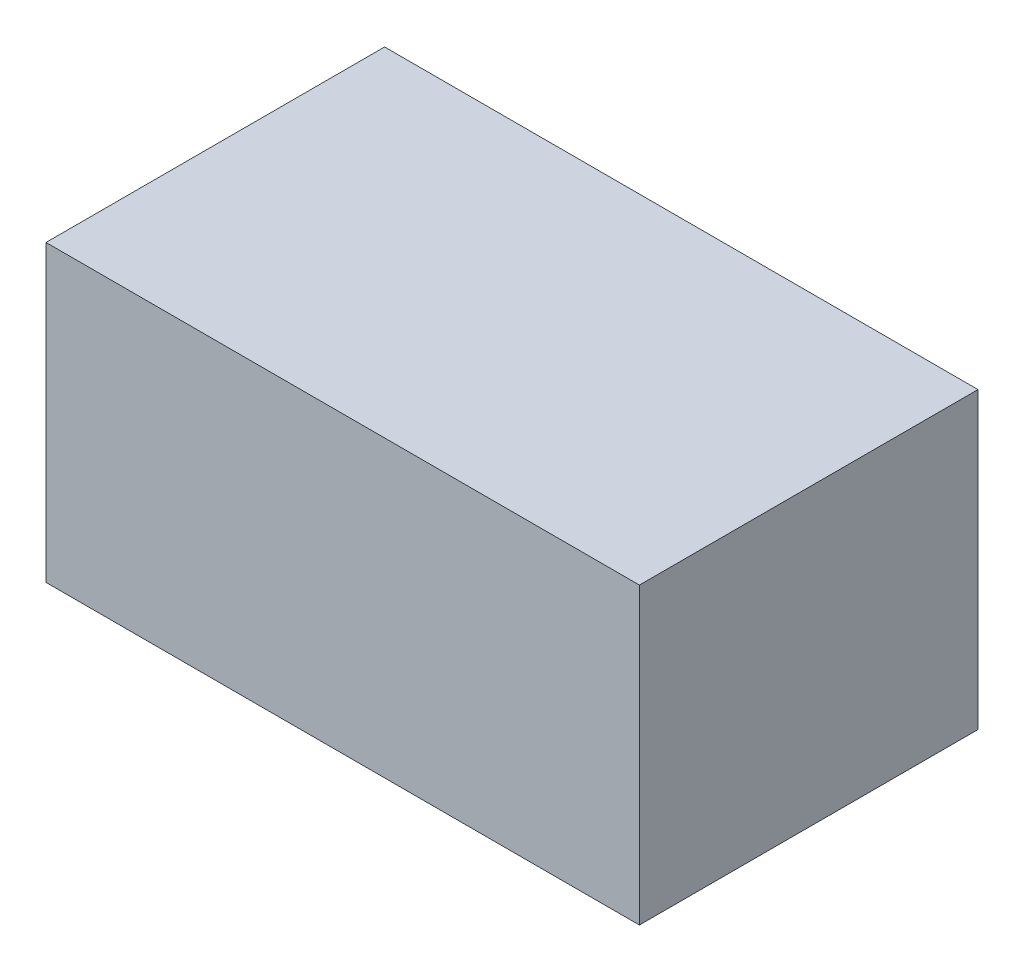
ISO-10303-21;
HEADER;
FILE_DESCRIPTION(('STEP AP214'),'2;1');
FILE_NAME('part.step','',(''),(''),'','','');
FILE_SCHEMA(('AUTOMOTIVE_DESIGN { 1 0 10303 214 1 1 1 1 }'));
ENDSEC;
DATA;
#1=APPLICATION_CONTEXT('core data for automotive mechanical design processes');
#2=APPLICATION_PROTOCOL_DEFINITION('international standard','automotive_design',2000,#1);
#3=PRODUCT_CONTEXT('',#1,'mechanical');
#4=PRODUCT('Part','Part','',(#3));
#5=PRODUCT_RELATED_PRODUCT_CATEGORY('part','',(#4));
#6=PRODUCT_DEFINITION_FORMATION('','',#4);
#7=PRODUCT_DEFINITION_CONTEXT('part definition',#1,'design');
#8=PRODUCT_DEFINITION('design','',#6,#7);
#9=PRODUCT_DEFINITION_SHAPE('','',#8);
#10=(LENGTH_UNIT() NAMED_UNIT(*) SI_UNIT(.MILLI.,.METRE.));
#11=(NAMED_UNIT(*) PLANE_ANGLE_UNIT() SI_UNIT($,.RADIAN.));
#12=(NAMED_UNIT(*) SI_UNIT($,.STERADIAN.) SOLID_ANGLE_UNIT());
#13=UNCERTAINTY_MEASURE_WITH_UNIT(LENGTH_MEASURE(1.E-05),#10,'distance_accuracy_value','');
#14=(GEOMETRIC_REPRESENTATION_CONTEXT(3) GLOBAL_UNCERTAINTY_ASSIGNED_CONTEXT((#13)) GLOBAL_UNIT_ASSIGNED_CONTEXT((#10,
#11,#12)) REPRESENTATION_CONTEXT('',''));
#15=CARTESIAN_POINT('',(0.,0.,0.));
#16=DIRECTION('',(0.,0.,1.));
#17=DIRECTION('',(1.,0.,0.));
#18=AXIS2_PLACEMENT_3D('',#15,#16,#17);
#19=CARTESIAN_POINT('',(4.55229940712927,-40.3391681794489,-8.80805698904395));
#20=DIRECTION('',(-1.,0.,0.));
#21=DIRECTION('',(0.,0.,1.));
#22=AXIS2_PLACEMENT_3D('',#19,#20,#21);
#23=PLANE('',#22);
#24=CARTESIAN_POINT('',(4.55229940712927,-40.2895505391591,-8.80805698904396));
#25=CARTESIAN_POINT('',(4.55229940712927,-40.2895505391591,-8.86511727537722));
#26=(BOUNDED_CURVE() B_SPLINE_CURVE(1,(#24,#25),.UNSPECIFIED.,.F.,
.F.) B_SPLINE_CURVE_WITH_KNOTS((2,2),(6.,7.),
.UNSPECIFIED.) CURVE() GEOMETRIC_REPRESENTATION_ITEM() RATIONAL_B_SPLINE_CURVE((1.,1.)) REPRESENTATION_ITEM(''));
#27=CARTESIAN_POINT('',(4.55229940712927,-40.2895505391591,-8.80805698904396));
#28=VERTEX_POINT('',#27);
#29=CARTESIAN_POINT('',(4.55229940712927,-40.2895505391591,-8.86511727537722));
#30=VERTEX_POINT('',#29);
#31=EDGE_CURVE('E94',#28,#30,#26,.T.);
#32=ORIENTED_EDGE('',*,*,#31,.T.);
#33=CARTESIAN_POINT('',(4.55229940712927,-40.2895505391591,-8.86511727537722));
#34=CARTESIAN_POINT('',(4.55229940712927,-40.3391681794489,-8.86511727537722));
#35=(BOUNDED_CURVE() B_SPLINE_CURVE(1,(#33,#34),.UNSPECIFIED.,.F.,
.F.) B_SPLINE_CURVE_WITH_KNOTS((2,2),(7.,8.),
.UNSPECIFIED.) CURVE() GEOMETRIC_REPRESENTATION_ITEM() RATIONAL_B_SPLINE_CURVE((1.,1.)) REPRESENTATION_ITEM(''));
#36=CARTESIAN_POINT('',(4.55229940712927,-40.3391681794489,-8.86511727537722));
#37=VERTEX_POINT('',#36);
#38=EDGE_CURVE('E78',#30,#37,#35,.T.);
#39=ORIENTED_EDGE('',*,*,#38,.T.);
#40=CARTESIAN_POINT('',(4.55229940712927,-40.3391681794489,-8.86511727537722));
#41=CARTESIAN_POINT('',(4.55229940712927,-40.3391681794489,-8.80805698904396));
#42=(BOUNDED_CURVE() B_SPLINE_CURVE(1,(#40,#41),.UNSPECIFIED.,.F.,
.F.) B_SPLINE_CURVE_WITH_KNOTS((2,2),(8.,9.),
.UNSPECIFIED.) CURVE() GEOMETRIC_REPRESENTATION_ITEM() RATIONAL_B_SPLINE_CURVE((1.,1.)) REPRESENTATION_ITEM(''));
#43=CARTESIAN_POINT('',(4.55229940712927,-40.3391681794489,-8.80805698904396));
#44=VERTEX_POINT('',#43);
#45=EDGE_CURVE('E65',#37,#44,#42,.T.);
#46=ORIENTED_EDGE('',*,*,#45,.T.);
#47=CARTESIAN_POINT('',(4.55229940712927,-40.3391681794489,-8.80805698904396));
#48=CARTESIAN_POINT('',(4.55229940712927,-40.2895505391591,-8.80805698904396));
#49=(BOUNDED_CURVE() B_SPLINE_CURVE(1,(#47,#48),.UNSPECIFIED.,.F.,
.F.) B_SPLINE_CURVE_WITH_KNOTS((2,2),(9.,10.),
.UNSPECIFIED.) CURVE() GEOMETRIC_REPRESENTATION_ITEM() RATIONAL_B_SPLINE_CURVE((1.,1.)) REPRESENTATION_ITEM(''));
#50=EDGE_CURVE('E11',#44,#28,#49,.T.);
#51=ORIENTED_EDGE('',*,*,#50,.T.);
#52=EDGE_LOOP('',(#32,#39,#46,#51));
#53=FACE_BOUND('',#52,.T.);
#54=ADVANCED_FACE('F16',(#53),#23,.T.);
#55=CARTESIAN_POINT('',(4.65229940712927,-40.3391681794489,-8.80805698904395));
#56=DIRECTION('',(1.,0.,0.));
#57=DIRECTION('',(0.,1.,0.));
#58=AXIS2_PLACEMENT_3D('',#55,#56,#57);
#59=PLANE('',#58);
#60=CARTESIAN_POINT('',(4.65229940712927,-40.3391681794489,-8.80805698904396));
#61=CARTESIAN_POINT('',(4.65229940712927,-40.2895505391591,-8.80805698904396));
#62=(BOUNDED_CURVE() B_SPLINE_CURVE(1,(#60,#61),.UNSPECIFIED.,.F.,
.F.) B_SPLINE_CURVE_WITH_KNOTS((2,2),(9.,10.),
.UNSPECIFIED.) CURVE() GEOMETRIC_REPRESENTATION_ITEM() RATIONAL_B_SPLINE_CURVE((1.,1.)) REPRESENTATION_ITEM(''));
#63=CARTESIAN_POINT('',(4.65229940712927,-40.3391681794489,-8.80805698904396));
#64=VERTEX_POINT('',#63);
#65=CARTESIAN_POINT('',(4.65229940712927,-40.2895505391591,-8.80805698904396));
#66=VERTEX_POINT('',#65);
#67=EDGE_CURVE('E29',#64,#66,#62,.T.);
#68=ORIENTED_EDGE('',*,*,#67,.F.);
#69=CARTESIAN_POINT('',(4.65229940712928,-40.3391681794489,-8.86511727537723));
#70=CARTESIAN_POINT('',(4.65229940712927,-40.3391681794489,-8.80805698904396));
#71=(BOUNDED_CURVE() B_SPLINE_CURVE(1,(#69,#70),.UNSPECIFIED.,.F.,
.F.) B_SPLINE_CURVE_WITH_KNOTS((2,2),(8.,9.),
.UNSPECIFIED.) CURVE() GEOMETRIC_REPRESENTATION_ITEM() RATIONAL_B_SPLINE_CURVE((1.,1.)) REPRESENTATION_ITEM(''));
#72=CARTESIAN_POINT('',(4.65229940712928,-40.3391681794489,-8.86511727537723));
#73=VERTEX_POINT('',#72);
#74=EDGE_CURVE('E20',#73,#64,#71,.T.);
#75=ORIENTED_EDGE('',*,*,#74,.F.);
#76=CARTESIAN_POINT('',(4.65229940712927,-40.2895505391591,-8.86511727537723));
#77=CARTESIAN_POINT('',(4.65229940712928,-40.3391681794489,-8.86511727537723));
#78=(BOUNDED_CURVE() B_SPLINE_CURVE(1,(#76,#77),.UNSPECIFIED.,.F.,
.F.) B_SPLINE_CURVE_WITH_KNOTS((2,2),(7.,8.),
.UNSPECIFIED.) CURVE() GEOMETRIC_REPRESENTATION_ITEM() RATIONAL_B_SPLINE_CURVE((1.,1.)) REPRESENTATION_ITEM(''));
#79=CARTESIAN_POINT('',(4.65229940712927,-40.2895505391591,-8.86511727537723));
#80=VERTEX_POINT('',#79);
#81=EDGE_CURVE('E74',#80,#73,#78,.T.);
#82=ORIENTED_EDGE('',*,*,#81,.F.);
#83=CARTESIAN_POINT('',(4.65229940712927,-40.2895505391591,-8.80805698904396));
#84=CARTESIAN_POINT('',(4.65229940712927,-40.2895505391591,-8.86511727537723));
#85=(BOUNDED_CURVE() B_SPLINE_CURVE(1,(#83,#84),.UNSPECIFIED.,.F.,
.F.) B_SPLINE_CURVE_WITH_KNOTS((2,2),(6.,7.),
.UNSPECIFIED.) CURVE() GEOMETRIC_REPRESENTATION_ITEM() RATIONAL_B_SPLINE_CURVE((1.,1.)) REPRESENTATION_ITEM(''));
#86=EDGE_CURVE('E133',#66,#80,#85,.T.);
#87=ORIENTED_EDGE('',*,*,#86,.F.);
#88=EDGE_LOOP('',(#68,#75,#82,#87));
#89=FACE_BOUND('',#88,.T.);
#90=ADVANCED_FACE('F18',(#89),#59,.T.);
#91=CARTESIAN_POINT('',(4.65229940712927,-40.3391681794489,-8.80805698904396));
#92=DIRECTION('',(0.,0.,1.));
#93=DIRECTION('',(1.,0.,0.));
#94=AXIS2_PLACEMENT_3D('',#91,#92,#93);
#95=PLANE('',#94);
#96=ORIENTED_EDGE('',*,*,#67,.T.);
#97=CARTESIAN_POINT('',(4.65229940712927,-40.2895505391591,-8.80805698904396));
#98=CARTESIAN_POINT('',(4.55229940712927,-40.2895505391591,-8.80805698904396));
#99=(BOUNDED_CURVE() B_SPLINE_CURVE(1,(#97,#98),.UNSPECIFIED.,.F.,
.F.) B_SPLINE_CURVE_WITH_KNOTS((2,2),(0.,0.1),
.UNSPECIFIED.) CURVE() GEOMETRIC_REPRESENTATION_ITEM() RATIONAL_B_SPLINE_CURVE((1.,1.)) REPRESENTATION_ITEM(''));
#100=EDGE_CURVE('E91',#66,#28,#99,.T.);
#101=ORIENTED_EDGE('',*,*,#100,.T.);
#102=ORIENTED_EDGE('',*,*,#50,.F.);
#103=CARTESIAN_POINT('',(4.65229940712927,-40.3391681794489,-8.80805698904396));
#104=CARTESIAN_POINT('',(4.55229940712927,-40.3391681794489,-8.80805698904396));
#105=(BOUNDED_CURVE() B_SPLINE_CURVE(1,(#103,#104),.UNSPECIFIED.,.F.,
.F.) B_SPLINE_CURVE_WITH_KNOTS((2,2),(0.,0.1),
.UNSPECIFIED.) CURVE() GEOMETRIC_REPRESENTATION_ITEM() RATIONAL_B_SPLINE_CURVE((1.,1.)) REPRESENTATION_ITEM(''));
#106=EDGE_CURVE('E77',#64,#44,#105,.T.);
#107=ORIENTED_EDGE('',*,*,#106,.F.);
#108=EDGE_LOOP('',(#96,#101,#102,#107));
#109=FACE_BOUND('',#108,.T.);
#110=ADVANCED_FACE('F169',(#109),#95,.T.);
#111=CARTESIAN_POINT('',(4.65229940712928,-40.3391681794489,-8.86511727537723));
#112=DIRECTION('',(0.,-1.,0.));
#113=DIRECTION('',(0.,0.,-1.));
#114=AXIS2_PLACEMENT_3D('',#111,#112,#113);
#115=PLANE('',#114);
#116=ORIENTED_EDGE('',*,*,#74,.T.);
#117=ORIENTED_EDGE('',*,*,#106,.T.);
#118=ORIENTED_EDGE('',*,*,#45,.F.);
#119=CARTESIAN_POINT('',(4.65229940712928,-40.3391681794489,-8.86511727537723));
#120=CARTESIAN_POINT('',(4.55229940712927,-40.3391681794489,-8.86511727537722));
#121=(BOUNDED_CURVE() B_SPLINE_CURVE(1,(#119,#120),.UNSPECIFIED.,.F.,
.F.) B_SPLINE_CURVE_WITH_KNOTS((2,2),(0.,0.1),
.UNSPECIFIED.) CURVE() GEOMETRIC_REPRESENTATION_ITEM() RATIONAL_B_SPLINE_CURVE((1.,1.)) REPRESENTATION_ITEM(''));
#122=EDGE_CURVE('E80',#73,#37,#121,.T.);
#123=ORIENTED_EDGE('',*,*,#122,.F.);
#124=EDGE_LOOP('',(#116,#117,#118,#123));
#125=FACE_BOUND('',#124,.T.);
#126=ADVANCED_FACE('F81',(#125),#115,.T.);
#127=CARTESIAN_POINT('',(4.65229940712927,-40.2895505391591,-8.86511727537723));
#128=DIRECTION('',(0.,0.,-1.));
#129=DIRECTION('',(0.,-1.,0.));
#130=AXIS2_PLACEMENT_3D('',#127,#128,#129);
#131=PLANE('',#130);
#132=ORIENTED_EDGE('',*,*,#81,.T.);
#133=ORIENTED_EDGE('',*,*,#122,.T.);
#134=ORIENTED_EDGE('',*,*,#38,.F.);
#135=CARTESIAN_POINT('',(4.65229940712927,-40.2895505391591,-8.86511727537723));
#136=CARTESIAN_POINT('',(4.55229940712927,-40.2895505391591,-8.86511727537722));
#137=(BOUNDED_CURVE() B_SPLINE_CURVE(1,(#135,#136),.UNSPECIFIED.,.F.,
.F.) B_SPLINE_CURVE_WITH_KNOTS((2,2),(0.,0.1),
.UNSPECIFIED.) CURVE() GEOMETRIC_REPRESENTATION_ITEM() RATIONAL_B_SPLINE_CURVE((1.,1.)) REPRESENTATION_ITEM(''));
#138=EDGE_CURVE('E88',#80,#30,#137,.T.);
#139=ORIENTED_EDGE('',*,*,#138,.F.);
#140=EDGE_LOOP('',(#132,#133,#134,#139));
#141=FACE_BOUND('',#140,.T.);
#142=ADVANCED_FACE('F86',(#141),#131,.T.);
#143=CARTESIAN_POINT('',(4.65229940712927,-40.2895505391591,-8.80805698904396));
#144=DIRECTION('',(0.,1.,0.));
#145=DIRECTION('',(1.,0.,0.));
#146=AXIS2_PLACEMENT_3D('',#143,#144,#145);
#147=PLANE('',#146);
#148=ORIENTED_EDGE('',*,*,#86,.T.);
#149=ORIENTED_EDGE('',*,*,#138,.T.);
#150=ORIENTED_EDGE('',*,*,#31,.F.);
#151=ORIENTED_EDGE('',*,*,#100,.F.);
#152=EDGE_LOOP('',(#148,#149,#150,#151));
#153=FACE_BOUND('',#152,.T.);
#154=ADVANCED_FACE('F173',(#153),#147,.T.);
#155=CLOSED_SHELL('',(#54,#90,#110,#126,#142,#154));
#156=MANIFOLD_SOLID_BREP('B1',#155);
#157=ADVANCED_BREP_SHAPE_REPRESENTATION('',(#18,#156),#14);
#158=SHAPE_DEFINITION_REPRESENTATION(#9,#157);
ENDSEC;
END-ISO-10303-21;
